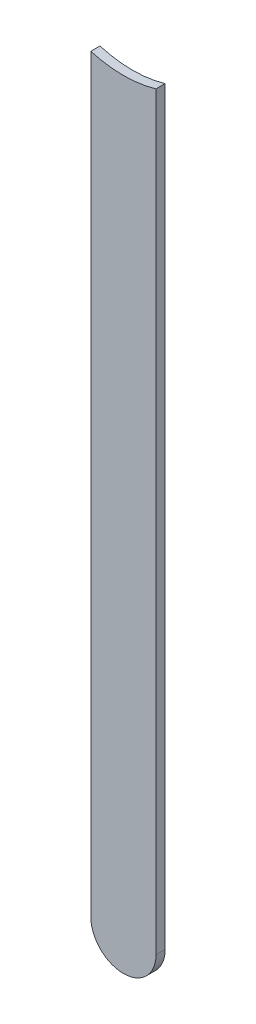
ISO-10303-21;
HEADER;
FILE_DESCRIPTION(('STEP AP214'),'2;1');
FILE_NAME('part.step','',(''),(''),'','','');
FILE_SCHEMA(('AUTOMOTIVE_DESIGN { 1 0 10303 214 1 1 1 1 }'));
ENDSEC;
DATA;
#1=APPLICATION_CONTEXT('core data for automotive mechanical design processes');
#2=APPLICATION_PROTOCOL_DEFINITION('international standard','automotive_design',2000,#1);
#3=PRODUCT_CONTEXT('',#1,'mechanical');
#4=PRODUCT('Part','Part','',(#3));
#5=PRODUCT_RELATED_PRODUCT_CATEGORY('part','',(#4));
#6=PRODUCT_DEFINITION_FORMATION('','',#4);
#7=PRODUCT_DEFINITION_CONTEXT('part definition',#1,'design');
#8=PRODUCT_DEFINITION('design','',#6,#7);
#9=PRODUCT_DEFINITION_SHAPE('','',#8);
#10=(LENGTH_UNIT() NAMED_UNIT(*) SI_UNIT(.MILLI.,.METRE.));
#11=(NAMED_UNIT(*) PLANE_ANGLE_UNIT() SI_UNIT($,.RADIAN.));
#12=(NAMED_UNIT(*) SI_UNIT($,.STERADIAN.) SOLID_ANGLE_UNIT());
#13=UNCERTAINTY_MEASURE_WITH_UNIT(LENGTH_MEASURE(1.E-05),#10,'distance_accuracy_value','');
#14=(GEOMETRIC_REPRESENTATION_CONTEXT(3) GLOBAL_UNCERTAINTY_ASSIGNED_CONTEXT((#13)) GLOBAL_UNIT_ASSIGNED_CONTEXT((#10,
#11,#12)) REPRESENTATION_CONTEXT('',''));
#15=CARTESIAN_POINT('',(0.,0.,0.));
#16=DIRECTION('',(0.,0.,1.));
#17=DIRECTION('',(1.,0.,0.));
#18=AXIS2_PLACEMENT_3D('',#15,#16,#17);
#19=CARTESIAN_POINT('',(86.4780084,89.21969456,0.));
#20=DIRECTION('',(-1.,0.,0.));
#21=DIRECTION('',(0.,1.,0.));
#22=AXIS2_PLACEMENT_3D('',#19,#20,#21);
#23=PLANE('',#22);
#24=DIRECTION('',(0.,1.,0.));
#25=VECTOR('',#24,1.);
#26=CARTESIAN_POINT('',(86.4780084,89.21969456,0.03556));
#27=LINE('',#26,#25);
#28=CARTESIAN_POINT('',(86.4780084,89.21969456,0.03556));
#29=VERTEX_POINT('',#28);
#30=CARTESIAN_POINT('',(86.4780084,92.1423022615206,0.03556));
#31=VERTEX_POINT('',#30);
#32=EDGE_CURVE('E11',#29,#31,#27,.T.);
#33=ORIENTED_EDGE('',*,*,#32,.F.);
#34=DIRECTION('',(0.,0.,1.));
#35=VECTOR('',#34,1.);
#36=CARTESIAN_POINT('',(86.4780084,89.21969456,0.));
#37=LINE('',#36,#35);
#38=CARTESIAN_POINT('',(86.4780084,89.21969456,0.));
#39=VERTEX_POINT('',#38);
#40=EDGE_CURVE('E24',#39,#29,#37,.T.);
#41=ORIENTED_EDGE('',*,*,#40,.F.);
#42=DIRECTION('',(0.,1.,0.));
#43=VECTOR('',#42,1.);
#44=CARTESIAN_POINT('',(86.4780084,89.21969456,0.));
#45=LINE('',#44,#43);
#46=CARTESIAN_POINT('',(86.4780084,92.1423022615206,0.));
#47=VERTEX_POINT('',#46);
#48=EDGE_CURVE('E75',#39,#47,#45,.T.);
#49=ORIENTED_EDGE('',*,*,#48,.T.);
#50=DIRECTION('',(0.,0.,1.));
#51=VECTOR('',#50,1.);
#52=CARTESIAN_POINT('',(86.4780084,92.1423022615206,0.));
#53=LINE('',#52,#51);
#54=EDGE_CURVE('E37',#47,#31,#53,.T.);
#55=ORIENTED_EDGE('',*,*,#54,.T.);
#56=EDGE_LOOP('',(#33,#41,#49,#55));
#57=FACE_BOUND('',#56,.T.);
#58=ADVANCED_FACE('F17',(#57),#23,.F.);
#59=CARTESIAN_POINT('',(86.3510084,92.5740084,0.));
#60=DIRECTION('',(0.,0.,-1.));
#61=DIRECTION('',(1.,0.,0.));
#62=AXIS2_PLACEMENT_3D('',#59,#60,#61);
#63=CYLINDRICAL_SURFACE('',#62,0.4499991);
#64=DIRECTION('',(0.,0.,1.));
#65=VECTOR('',#64,1.);
#66=CARTESIAN_POINT('',(86.2240084,92.1423022615206,0.));
#67=LINE('',#66,#65);
#68=CARTESIAN_POINT('',(86.2240084,92.1423022615206,0.));
#69=VERTEX_POINT('',#68);
#70=CARTESIAN_POINT('',(86.2240084,92.1423022615206,0.03556));
#71=VERTEX_POINT('',#70);
#72=EDGE_CURVE('E67',#69,#71,#67,.T.);
#73=ORIENTED_EDGE('',*,*,#72,.T.);
#74=CARTESIAN_POINT('',(86.3510084,92.5740084,0.03556));
#75=DIRECTION('',(0.,0.,1.));
#76=DIRECTION('',(1.,0.,0.));
#77=AXIS2_PLACEMENT_3D('',#74,#75,#76);
#78=CIRCLE('',#77,0.4499991);
#79=EDGE_CURVE('E82',#71,#31,#78,.T.);
#80=ORIENTED_EDGE('',*,*,#79,.T.);
#81=ORIENTED_EDGE('',*,*,#54,.F.);
#82=CARTESIAN_POINT('',(86.3510084,92.5740084,0.));
#83=DIRECTION('',(0.,0.,1.));
#84=DIRECTION('',(1.,0.,0.));
#85=AXIS2_PLACEMENT_3D('',#82,#83,#84);
#86=CIRCLE('',#85,0.4499991);
#87=EDGE_CURVE('E80',#69,#47,#86,.T.);
#88=ORIENTED_EDGE('',*,*,#87,.F.);
#89=EDGE_LOOP('',(#73,#80,#81,#88));
#90=FACE_BOUND('',#89,.T.);
#91=ADVANCED_FACE('F88',(#90),#63,.F.);
#92=CARTESIAN_POINT('',(86.2240084,92.1423022615206,0.));
#93=DIRECTION('',(1.,0.,0.));
#94=DIRECTION('',(0.,-1.,0.));
#95=AXIS2_PLACEMENT_3D('',#92,#93,#94);
#96=PLANE('',#95);
#97=DIRECTION('',(0.,-1.,0.));
#98=VECTOR('',#97,1.);
#99=CARTESIAN_POINT('',(86.2240084,92.5740084,0.03556));
#100=LINE('',#99,#98);
#101=CARTESIAN_POINT('',(86.2240084,89.21969456,0.03556));
#102=VERTEX_POINT('',#101);
#103=EDGE_CURVE('E71',#71,#102,#100,.T.);
#104=ORIENTED_EDGE('',*,*,#103,.F.);
#105=ORIENTED_EDGE('',*,*,#72,.F.);
#106=DIRECTION('',(0.,-1.,0.));
#107=VECTOR('',#106,1.);
#108=CARTESIAN_POINT('',(86.2240084,92.5740084,0.));
#109=LINE('',#108,#107);
#110=CARTESIAN_POINT('',(86.2240084,89.21969456,0.));
#111=VERTEX_POINT('',#110);
#112=EDGE_CURVE('E63',#69,#111,#109,.T.);
#113=ORIENTED_EDGE('',*,*,#112,.T.);
#114=DIRECTION('',(0.,0.,1.));
#115=VECTOR('',#114,1.);
#116=CARTESIAN_POINT('',(86.2240084,89.21969456,0.));
#117=LINE('',#116,#115);
#118=EDGE_CURVE('E53',#111,#102,#117,.T.);
#119=ORIENTED_EDGE('',*,*,#118,.T.);
#120=EDGE_LOOP('',(#104,#105,#113,#119));
#121=FACE_BOUND('',#120,.T.);
#122=ADVANCED_FACE('F66',(#121),#96,.F.);
#123=CARTESIAN_POINT('',(86.3510084,89.21969456,0.));
#124=DIRECTION('',(0.,0.,-1.));
#125=DIRECTION('',(-1.,0.,0.));
#126=AXIS2_PLACEMENT_3D('',#123,#124,#125);
#127=CYLINDRICAL_SURFACE('',#126,0.127);
#128=CARTESIAN_POINT('',(86.3510084,89.21969456,0.03556));
#129=DIRECTION('',(0.,0.,1.));
#130=DIRECTION('',(-1.,0.,0.));
#131=AXIS2_PLACEMENT_3D('',#128,#129,#130);
#132=CIRCLE('',#131,0.127);
#133=EDGE_CURVE('E59',#102,#29,#132,.T.);
#134=ORIENTED_EDGE('',*,*,#133,.F.);
#135=ORIENTED_EDGE('',*,*,#118,.F.);
#136=CARTESIAN_POINT('',(86.3510084,89.21969456,0.));
#137=DIRECTION('',(0.,0.,1.));
#138=DIRECTION('',(-1.,0.,0.));
#139=AXIS2_PLACEMENT_3D('',#136,#137,#138);
#140=CIRCLE('',#139,0.127);
#141=EDGE_CURVE('E57',#111,#39,#140,.T.);
#142=ORIENTED_EDGE('',*,*,#141,.T.);
#143=ORIENTED_EDGE('',*,*,#40,.T.);
#144=EDGE_LOOP('',(#134,#135,#142,#143));
#145=FACE_BOUND('',#144,.T.);
#146=ADVANCED_FACE('F55',(#145),#127,.T.);
#147=CARTESIAN_POINT('',(86.4780084,89.21969456,0.));
#148=DIRECTION('',(0.,0.,-1.));
#149=DIRECTION('',(-1.,0.,0.));
#150=AXIS2_PLACEMENT_3D('',#147,#148,#149);
#151=PLANE('',#150);
#152=ORIENTED_EDGE('',*,*,#48,.F.);
#153=ORIENTED_EDGE('',*,*,#141,.F.);
#154=ORIENTED_EDGE('',*,*,#112,.F.);
#155=ORIENTED_EDGE('',*,*,#87,.T.);
#156=EDGE_LOOP('',(#152,#153,#154,#155));
#157=FACE_BOUND('',#156,.T.);
#158=ADVANCED_FACE('F74',(#157),#151,.T.);
#159=CARTESIAN_POINT('',(86.4780084,89.21969456,0.03556));
#160=DIRECTION('',(0.,0.,-1.));
#161=DIRECTION('',(-1.,0.,0.));
#162=AXIS2_PLACEMENT_3D('',#159,#160,#161);
#163=PLANE('',#162);
#164=ORIENTED_EDGE('',*,*,#133,.T.);
#165=ORIENTED_EDGE('',*,*,#32,.T.);
#166=ORIENTED_EDGE('',*,*,#79,.F.);
#167=ORIENTED_EDGE('',*,*,#103,.T.);
#168=EDGE_LOOP('',(#164,#165,#166,#167));
#169=FACE_BOUND('',#168,.T.);
#170=ADVANCED_FACE('F91',(#169),#163,.F.);
#171=CLOSED_SHELL('',(#58,#91,#122,#146,#158,#170));
#172=MANIFOLD_SOLID_BREP('B1',#171);
#173=ADVANCED_BREP_SHAPE_REPRESENTATION('',(#18,#172),#14);
#174=SHAPE_DEFINITION_REPRESENTATION(#9,#173);
ENDSEC;
END-ISO-10303-21;
